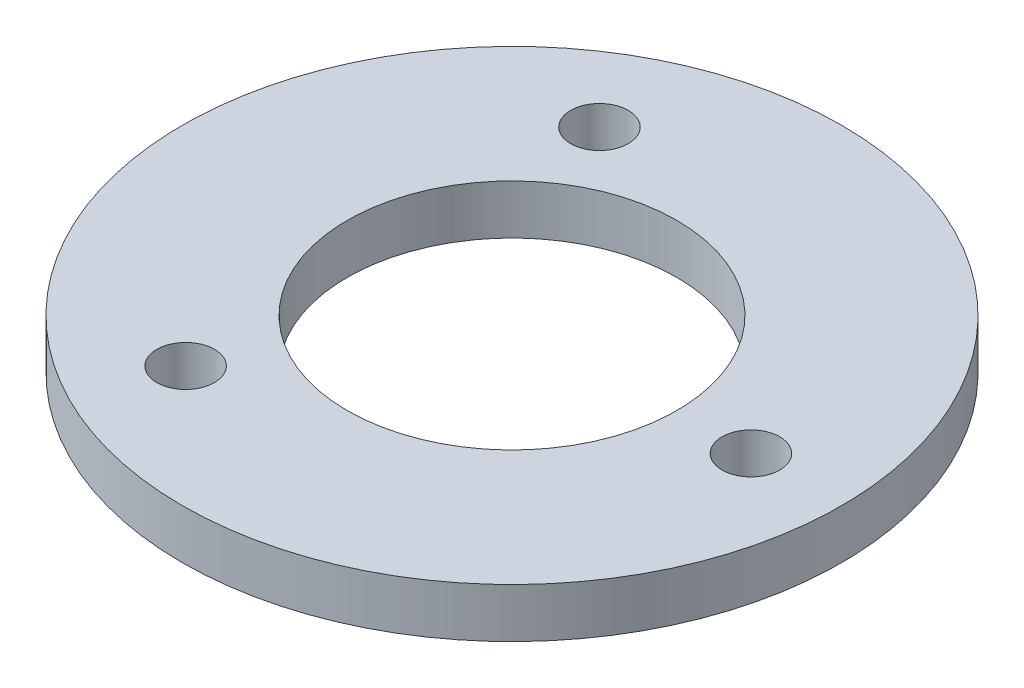
ISO-10303-21;
HEADER;
FILE_DESCRIPTION(('STEP AP214'),'2;1');
FILE_NAME('part.step','',(''),(''),'','','');
FILE_SCHEMA(('AUTOMOTIVE_DESIGN { 1 0 10303 214 1 1 1 1 }'));
ENDSEC;
DATA;
#1=APPLICATION_CONTEXT('core data for automotive mechanical design processes');
#2=APPLICATION_PROTOCOL_DEFINITION('international standard','automotive_design',2000,#1);
#3=PRODUCT_CONTEXT('',#1,'mechanical');
#4=PRODUCT('Part','Part','',(#3));
#5=PRODUCT_RELATED_PRODUCT_CATEGORY('part','',(#4));
#6=PRODUCT_DEFINITION_FORMATION('','',#4);
#7=PRODUCT_DEFINITION_CONTEXT('part definition',#1,'design');
#8=PRODUCT_DEFINITION('design','',#6,#7);
#9=PRODUCT_DEFINITION_SHAPE('','',#8);
#10=(LENGTH_UNIT() NAMED_UNIT(*) SI_UNIT(.MILLI.,.METRE.));
#11=(NAMED_UNIT(*) PLANE_ANGLE_UNIT() SI_UNIT($,.RADIAN.));
#12=(NAMED_UNIT(*) SI_UNIT($,.STERADIAN.) SOLID_ANGLE_UNIT());
#13=UNCERTAINTY_MEASURE_WITH_UNIT(LENGTH_MEASURE(1.E-05),#10,'distance_accuracy_value','');
#14=(GEOMETRIC_REPRESENTATION_CONTEXT(3) GLOBAL_UNCERTAINTY_ASSIGNED_CONTEXT((#13)) GLOBAL_UNIT_ASSIGNED_CONTEXT((#10,
#11,#12)) REPRESENTATION_CONTEXT('',''));
#15=CARTESIAN_POINT('',(0.,0.,0.));
#16=DIRECTION('',(0.,0.,1.));
#17=DIRECTION('',(1.,0.,0.));
#18=AXIS2_PLACEMENT_3D('',#15,#16,#17);
#19=CARTESIAN_POINT('',(0.,3.,0.));
#20=DIRECTION('',(0.,1.,0.));
#21=DIRECTION('',(0.,0.,1.));
#22=AXIS2_PLACEMENT_3D('',#19,#20,#21);
#23=PLANE('',#22);
#24=CARTESIAN_POINT('',(-7.25000000000006,3.,12.5573683548743));
#25=DIRECTION('',(0.,1.,0.));
#26=DIRECTION('',(0.,0.,1.));
#27=AXIS2_PLACEMENT_3D('',#24,#25,#26);
#28=CIRCLE('',#27,1.75);
#29=CARTESIAN_POINT('',(-7.25000000000006,3.,14.3073683548743));
#30=VERTEX_POINT('',#29);
#31=EDGE_CURVE('E64',#30,#30,#28,.T.);
#32=ORIENTED_EDGE('',*,*,#31,.F.);
#33=EDGE_LOOP('',(#32));
#34=FACE_BOUND('',#33,.T.);
#35=CARTESIAN_POINT('',(0.,3.,0.));
#36=DIRECTION('',(0.,1.,0.));
#37=DIRECTION('',(0.,0.,1.));
#38=AXIS2_PLACEMENT_3D('',#35,#36,#37);
#39=CIRCLE('',#38,10.);
#40=CARTESIAN_POINT('',(0.,3.,10.));
#41=VERTEX_POINT('',#40);
#42=EDGE_CURVE('E50',#41,#41,#39,.T.);
#43=ORIENTED_EDGE('',*,*,#42,.F.);
#44=EDGE_LOOP('',(#43));
#45=FACE_BOUND('',#44,.T.);
#46=CARTESIAN_POINT('',(0.,3.,0.));
#47=DIRECTION('',(0.,1.,0.));
#48=DIRECTION('',(0.,0.,1.));
#49=AXIS2_PLACEMENT_3D('',#46,#47,#48);
#50=CIRCLE('',#49,20.);
#51=CARTESIAN_POINT('',(0.,3.,20.));
#52=VERTEX_POINT('',#51);
#53=EDGE_CURVE('E10',#52,#52,#50,.T.);
#54=ORIENTED_EDGE('',*,*,#53,.T.);
#55=EDGE_LOOP('',(#54));
#56=FACE_BOUND('',#55,.T.);
#57=CARTESIAN_POINT('',(14.5,3.,0.));
#58=DIRECTION('',(0.,1.,0.));
#59=DIRECTION('',(0.,0.,1.));
#60=AXIS2_PLACEMENT_3D('',#57,#58,#59);
#61=CIRCLE('',#60,1.75);
#62=CARTESIAN_POINT('',(14.5,3.,1.75));
#63=VERTEX_POINT('',#62);
#64=EDGE_CURVE('E56',#63,#63,#61,.T.);
#65=ORIENTED_EDGE('',*,*,#64,.F.);
#66=EDGE_LOOP('',(#65));
#67=FACE_BOUND('',#66,.T.);
#68=CARTESIAN_POINT('',(-7.24999999999988,3.,-12.5573683548744));
#69=DIRECTION('',(0.,1.,0.));
#70=DIRECTION('',(0.,0.,1.));
#71=AXIS2_PLACEMENT_3D('',#68,#69,#70);
#72=CIRCLE('',#71,1.75);
#73=CARTESIAN_POINT('',(-7.24999999999988,3.,-10.8073683548744));
#74=VERTEX_POINT('',#73);
#75=EDGE_CURVE('E72',#74,#74,#72,.T.);
#76=ORIENTED_EDGE('',*,*,#75,.F.);
#77=EDGE_LOOP('',(#76));
#78=FACE_BOUND('',#77,.T.);
#79=ADVANCED_FACE('F37',(#34,#45,#56,#67,#78),#23,.T.);
#80=CARTESIAN_POINT('',(0.,0.,0.));
#81=DIRECTION('',(0.,1.,0.));
#82=DIRECTION('',(0.,0.,1.));
#83=AXIS2_PLACEMENT_3D('',#80,#81,#82);
#84=PLANE('',#83);
#85=CARTESIAN_POINT('',(0.,0.,0.));
#86=DIRECTION('',(0.,1.,0.));
#87=DIRECTION('',(0.,0.,1.));
#88=AXIS2_PLACEMENT_3D('',#85,#86,#87);
#89=CIRCLE('',#88,20.);
#90=CARTESIAN_POINT('',(0.,0.,20.));
#91=VERTEX_POINT('',#90);
#92=EDGE_CURVE('E41',#91,#91,#89,.T.);
#93=ORIENTED_EDGE('',*,*,#92,.F.);
#94=EDGE_LOOP('',(#93));
#95=FACE_BOUND('',#94,.T.);
#96=CARTESIAN_POINT('',(0.,0.,0.));
#97=DIRECTION('',(0.,1.,0.));
#98=DIRECTION('',(0.,0.,1.));
#99=AXIS2_PLACEMENT_3D('',#96,#97,#98);
#100=CIRCLE('',#99,10.);
#101=CARTESIAN_POINT('',(0.,0.,10.));
#102=VERTEX_POINT('',#101);
#103=EDGE_CURVE('E52',#102,#102,#100,.T.);
#104=ORIENTED_EDGE('',*,*,#103,.T.);
#105=EDGE_LOOP('',(#104));
#106=FACE_BOUND('',#105,.T.);
#107=CARTESIAN_POINT('',(14.5,0.,0.));
#108=DIRECTION('',(0.,1.,0.));
#109=DIRECTION('',(0.,0.,1.));
#110=AXIS2_PLACEMENT_3D('',#107,#108,#109);
#111=CIRCLE('',#110,1.75);
#112=CARTESIAN_POINT('',(14.5,0.,1.75));
#113=VERTEX_POINT('',#112);
#114=EDGE_CURVE('E60',#113,#113,#111,.T.);
#115=ORIENTED_EDGE('',*,*,#114,.T.);
#116=EDGE_LOOP('',(#115));
#117=FACE_BOUND('',#116,.T.);
#118=CARTESIAN_POINT('',(-7.25000000000006,0.,12.5573683548743));
#119=DIRECTION('',(0.,1.,0.));
#120=DIRECTION('',(0.,0.,1.));
#121=AXIS2_PLACEMENT_3D('',#118,#119,#120);
#122=CIRCLE('',#121,1.75);
#123=CARTESIAN_POINT('',(-7.25000000000006,0.,14.3073683548743));
#124=VERTEX_POINT('',#123);
#125=EDGE_CURVE('E68',#124,#124,#122,.T.);
#126=ORIENTED_EDGE('',*,*,#125,.T.);
#127=EDGE_LOOP('',(#126));
#128=FACE_BOUND('',#127,.T.);
#129=CARTESIAN_POINT('',(-7.24999999999988,0.,-12.5573683548744));
#130=DIRECTION('',(0.,1.,0.));
#131=DIRECTION('',(0.,0.,1.));
#132=AXIS2_PLACEMENT_3D('',#129,#130,#131);
#133=CIRCLE('',#132,1.75);
#134=CARTESIAN_POINT('',(-7.24999999999988,0.,-10.8073683548744));
#135=VERTEX_POINT('',#134);
#136=EDGE_CURVE('E76',#135,#135,#133,.T.);
#137=ORIENTED_EDGE('',*,*,#136,.T.);
#138=EDGE_LOOP('',(#137));
#139=FACE_BOUND('',#138,.T.);
#140=ADVANCED_FACE('F88',(#95,#106,#117,#128,#139),#84,.F.);
#141=CARTESIAN_POINT('',(0.,3.,0.));
#142=DIRECTION('',(0.,-1.,0.));
#143=DIRECTION('',(0.,0.,-1.));
#144=AXIS2_PLACEMENT_3D('',#141,#142,#143);
#145=CYLINDRICAL_SURFACE('',#144,20.);
#146=ORIENTED_EDGE('',*,*,#53,.F.);
#147=EDGE_LOOP('',(#146));
#148=FACE_BOUND('',#147,.T.);
#149=ORIENTED_EDGE('',*,*,#92,.T.);
#150=EDGE_LOOP('',(#149));
#151=FACE_BOUND('',#150,.T.);
#152=ADVANCED_FACE('F39',(#148,#151),#145,.T.);
#153=CARTESIAN_POINT('',(0.,3.,0.));
#154=DIRECTION('',(0.,-1.,0.));
#155=DIRECTION('',(0.,0.,-1.));
#156=AXIS2_PLACEMENT_3D('',#153,#154,#155);
#157=CYLINDRICAL_SURFACE('',#156,10.);
#158=ORIENTED_EDGE('',*,*,#42,.T.);
#159=EDGE_LOOP('',(#158));
#160=FACE_BOUND('',#159,.T.);
#161=ORIENTED_EDGE('',*,*,#103,.F.);
#162=EDGE_LOOP('',(#161));
#163=FACE_BOUND('',#162,.T.);
#164=ADVANCED_FACE('F98',(#160,#163),#157,.F.);
#165=CARTESIAN_POINT('',(14.5,3.,0.));
#166=DIRECTION('',(0.,-1.,0.));
#167=DIRECTION('',(0.,0.,-1.));
#168=AXIS2_PLACEMENT_3D('',#165,#166,#167);
#169=CYLINDRICAL_SURFACE('',#168,1.75);
#170=ORIENTED_EDGE('',*,*,#64,.T.);
#171=EDGE_LOOP('',(#170));
#172=FACE_BOUND('',#171,.T.);
#173=ORIENTED_EDGE('',*,*,#114,.F.);
#174=EDGE_LOOP('',(#173));
#175=FACE_BOUND('',#174,.T.);
#176=ADVANCED_FACE('F101',(#172,#175),#169,.F.);
#177=CARTESIAN_POINT('',(-7.25000000000006,3.,12.5573683548743));
#178=DIRECTION('',(0.,-1.,0.));
#179=DIRECTION('',(0.,0.,-1.));
#180=AXIS2_PLACEMENT_3D('',#177,#178,#179);
#181=CYLINDRICAL_SURFACE('',#180,1.75);
#182=ORIENTED_EDGE('',*,*,#31,.T.);
#183=EDGE_LOOP('',(#182));
#184=FACE_BOUND('',#183,.T.);
#185=ORIENTED_EDGE('',*,*,#125,.F.);
#186=EDGE_LOOP('',(#185));
#187=FACE_BOUND('',#186,.T.);
#188=ADVANCED_FACE('F105',(#184,#187),#181,.F.);
#189=CARTESIAN_POINT('',(-7.24999999999988,3.,-12.5573683548744));
#190=DIRECTION('',(0.,-1.,0.));
#191=DIRECTION('',(0.,0.,-1.));
#192=AXIS2_PLACEMENT_3D('',#189,#190,#191);
#193=CYLINDRICAL_SURFACE('',#192,1.75);
#194=ORIENTED_EDGE('',*,*,#75,.T.);
#195=EDGE_LOOP('',(#194));
#196=FACE_BOUND('',#195,.T.);
#197=ORIENTED_EDGE('',*,*,#136,.F.);
#198=EDGE_LOOP('',(#197));
#199=FACE_BOUND('',#198,.T.);
#200=ADVANCED_FACE('F84',(#196,#199),#193,.F.);
#201=CLOSED_SHELL('',(#79,#140,#152,#164,#176,#188,#200));
#202=MANIFOLD_SOLID_BREP('B2',#201);
#203=ADVANCED_BREP_SHAPE_REPRESENTATION('',(#18,#202),#14);
#204=SHAPE_DEFINITION_REPRESENTATION(#9,#203);
ENDSEC;
END-ISO-10303-21;
